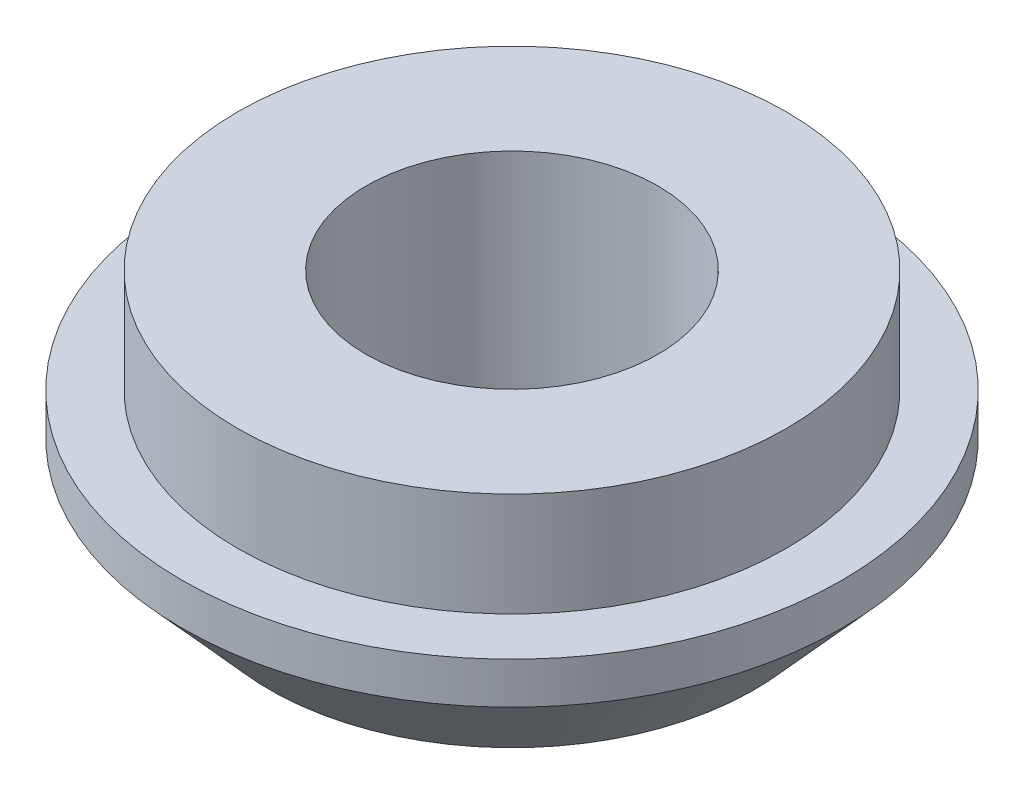
ISO-10303-21;
HEADER;
FILE_DESCRIPTION(('STEP AP214'),'2;1');
FILE_NAME('part.step','',(''),(''),'','','');
FILE_SCHEMA(('AUTOMOTIVE_DESIGN { 1 0 10303 214 1 1 1 1 }'));
ENDSEC;
DATA;
#1=APPLICATION_CONTEXT('core data for automotive mechanical design processes');
#2=APPLICATION_PROTOCOL_DEFINITION('international standard','automotive_design',2000,#1);
#3=PRODUCT_CONTEXT('',#1,'mechanical');
#4=PRODUCT('Part','Part','',(#3));
#5=PRODUCT_RELATED_PRODUCT_CATEGORY('part','',(#4));
#6=PRODUCT_DEFINITION_FORMATION('','',#4);
#7=PRODUCT_DEFINITION_CONTEXT('part definition',#1,'design');
#8=PRODUCT_DEFINITION('design','',#6,#7);
#9=PRODUCT_DEFINITION_SHAPE('','',#8);
#10=(LENGTH_UNIT() NAMED_UNIT(*) SI_UNIT(.MILLI.,.METRE.));
#11=(NAMED_UNIT(*) PLANE_ANGLE_UNIT() SI_UNIT($,.RADIAN.));
#12=(NAMED_UNIT(*) SI_UNIT($,.STERADIAN.) SOLID_ANGLE_UNIT());
#13=UNCERTAINTY_MEASURE_WITH_UNIT(LENGTH_MEASURE(1.E-05),#10,'distance_accuracy_value','');
#14=(GEOMETRIC_REPRESENTATION_CONTEXT(3) GLOBAL_UNCERTAINTY_ASSIGNED_CONTEXT((#13)) GLOBAL_UNIT_ASSIGNED_CONTEXT((#10,
#11,#12)) REPRESENTATION_CONTEXT('',''));
#15=CARTESIAN_POINT('',(0.,0.,0.));
#16=DIRECTION('',(0.,0.,1.));
#17=DIRECTION('',(1.,0.,0.));
#18=AXIS2_PLACEMENT_3D('',#15,#16,#17);
#19=CARTESIAN_POINT('',(-4.44089209850063E-13,7.00000000000009,2.22044604925031E-13));
#20=DIRECTION('',(0.,-1.,0.));
#21=DIRECTION('',(0.,0.,-1.));
#22=AXIS2_PLACEMENT_3D('',#19,#20,#21);
#23=CYLINDRICAL_SURFACE('',#22,9.525);
#24=CARTESIAN_POINT('',(8.88178419700125E-13,4.00000000000023,1.66533453693773E-13));
#25=DIRECTION('',(0.,1.,0.));
#26=DIRECTION('',(0.,0.,1.));
#27=AXIS2_PLACEMENT_3D('',#24,#25,#26);
#28=CIRCLE('',#27,9.525);
#29=CARTESIAN_POINT('',(8.91350881992992E-13,4.00000000000023,9.52500000000016));
#30=VERTEX_POINT('',#29);
#31=EDGE_CURVE('E47',#30,#30,#28,.T.);
#32=ORIENTED_EDGE('',*,*,#31,.F.);
#33=EDGE_LOOP('',(#32));
#34=FACE_BOUND('',#33,.T.);
#35=CARTESIAN_POINT('',(4.44089209850063E-13,2.80000000000014,1.11022302462516E-13));
#36=DIRECTION('',(0.,-1.,0.));
#37=DIRECTION('',(0.,0.,-1.));
#38=AXIS2_PLACEMENT_3D('',#35,#36,#37);
#39=CIRCLE('',#38,9.525);
#40=CARTESIAN_POINT('',(4.40916747557196E-13,2.80000000000013,-9.52499999999989));
#41=VERTEX_POINT('',#40);
#42=EDGE_CURVE('E61',#41,#41,#39,.T.);
#43=ORIENTED_EDGE('',*,*,#42,.F.);
#44=EDGE_LOOP('',(#43));
#45=FACE_BOUND('',#44,.T.);
#46=ADVANCED_FACE('F44',(#34,#45),#23,.T.);
#47=CARTESIAN_POINT('',(0.,0.,0.));
#48=DIRECTION('',(0.,1.,0.));
#49=DIRECTION('',(0.,0.,1.));
#50=AXIS2_PLACEMENT_3D('',#47,#48,#49);
#51=PLANE('',#50);
#52=CARTESIAN_POINT('',(0.,0.,0.));
#53=DIRECTION('',(0.,-1.,0.));
#54=DIRECTION('',(0.,0.,-1.));
#55=AXIS2_PLACEMENT_3D('',#52,#53,#54);
#56=CIRCLE('',#55,4.21639999999999);
#57=CARTESIAN_POINT('',(0.,0.,-4.21639999999999));
#58=VERTEX_POINT('',#57);
#59=EDGE_CURVE('E51',#58,#58,#56,.T.);
#60=ORIENTED_EDGE('',*,*,#59,.F.);
#61=EDGE_LOOP('',(#60));
#62=FACE_BOUND('',#61,.T.);
#63=CARTESIAN_POINT('',(0.,0.,0.));
#64=DIRECTION('',(0.,-1.,0.));
#65=DIRECTION('',(0.,0.,-1.));
#66=AXIS2_PLACEMENT_3D('',#63,#64,#65);
#67=CIRCLE('',#66,7.);
#68=CARTESIAN_POINT('',(0.,0.,-7.));
#69=VERTEX_POINT('',#68);
#70=EDGE_CURVE('E66',#69,#69,#67,.T.);
#71=ORIENTED_EDGE('',*,*,#70,.T.);
#72=EDGE_LOOP('',(#71));
#73=FACE_BOUND('',#72,.T.);
#74=ADVANCED_FACE('F70',(#62,#73),#51,.F.);
#75=CARTESIAN_POINT('',(-4.44089209850063E-13,7.00000000000009,2.22044604925031E-13));
#76=DIRECTION('',(0.,1.,0.));
#77=DIRECTION('',(0.,0.,1.));
#78=AXIS2_PLACEMENT_3D('',#75,#76,#77);
#79=PLANE('',#78);
#80=CARTESIAN_POINT('',(-4.44089209850063E-13,7.00000000000009,2.22044604925031E-13));
#81=DIRECTION('',(0.,-1.,0.));
#82=DIRECTION('',(0.,0.,-1.));
#83=AXIS2_PLACEMENT_3D('',#80,#81,#82);
#84=CIRCLE('',#83,4.2164);
#85=CARTESIAN_POINT('',(-4.45493553158372E-13,7.00000000000009,-4.21639999999977));
#86=VERTEX_POINT('',#85);
#87=EDGE_CURVE('E11',#86,#86,#84,.T.);
#88=ORIENTED_EDGE('',*,*,#87,.T.);
#89=EDGE_LOOP('',(#88));
#90=FACE_BOUND('',#89,.T.);
#91=CARTESIAN_POINT('',(-4.44089209850063E-13,7.00000000000009,2.22044604925031E-13));
#92=DIRECTION('',(0.,1.,0.));
#93=DIRECTION('',(0.,0.,1.));
#94=AXIS2_PLACEMENT_3D('',#91,#92,#93);
#95=CIRCLE('',#94,7.925);
#96=CARTESIAN_POINT('',(-4.41449654609016E-13,7.00000000000009,7.92500000000022));
#97=VERTEX_POINT('',#96);
#98=EDGE_CURVE('E57',#97,#97,#95,.T.);
#99=ORIENTED_EDGE('',*,*,#98,.T.);
#100=EDGE_LOOP('',(#99));
#101=FACE_BOUND('',#100,.T.);
#102=ADVANCED_FACE('F87',(#90,#101),#79,.T.);
#103=CARTESIAN_POINT('',(0.,0.,0.));
#104=DIRECTION('',(0.,-1.,0.));
#105=DIRECTION('',(0.,0.,-1.));
#106=AXIS2_PLACEMENT_3D('',#103,#104,#105);
#107=CYLINDRICAL_SURFACE('',#106,4.21639999999999);
#108=ORIENTED_EDGE('',*,*,#87,.F.);
#109=EDGE_LOOP('',(#108));
#110=FACE_BOUND('',#109,.T.);
#111=ORIENTED_EDGE('',*,*,#59,.T.);
#112=EDGE_LOOP('',(#111));
#113=FACE_BOUND('',#112,.T.);
#114=ADVANCED_FACE('F95',(#110,#113),#107,.F.);
#115=CARTESIAN_POINT('',(8.88178419700125E-13,4.00000000000023,1.66533453693773E-13));
#116=DIRECTION('',(0.,1.,0.));
#117=DIRECTION('',(0.,0.,1.));
#118=AXIS2_PLACEMENT_3D('',#115,#116,#117);
#119=PLANE('',#118);
#120=CARTESIAN_POINT('',(8.88178419700125E-13,4.00000000000023,1.66533453693773E-13));
#121=DIRECTION('',(0.,1.,0.));
#122=DIRECTION('',(0.,0.,1.));
#123=AXIS2_PLACEMENT_3D('',#120,#121,#122);
#124=CIRCLE('',#123,7.925);
#125=CARTESIAN_POINT('',(8.90817974941172E-13,4.00000000000023,7.92500000000016));
#126=VERTEX_POINT('',#125);
#127=EDGE_CURVE('E60',#126,#126,#124,.T.);
#128=ORIENTED_EDGE('',*,*,#127,.F.);
#129=EDGE_LOOP('',(#128));
#130=FACE_BOUND('',#129,.T.);
#131=ORIENTED_EDGE('',*,*,#31,.T.);
#132=EDGE_LOOP('',(#131));
#133=FACE_BOUND('',#132,.T.);
#134=ADVANCED_FACE('F80',(#130,#133),#119,.T.);
#135=CARTESIAN_POINT('',(8.88178419700125E-13,4.00000000000023,1.66533453693773E-13));
#136=DIRECTION('',(0.,1.,0.));
#137=DIRECTION('',(0.,0.,1.));
#138=AXIS2_PLACEMENT_3D('',#135,#136,#137);
#139=CYLINDRICAL_SURFACE('',#138,7.925);
#140=ORIENTED_EDGE('',*,*,#127,.T.);
#141=EDGE_LOOP('',(#140));
#142=FACE_BOUND('',#141,.T.);
#143=ORIENTED_EDGE('',*,*,#98,.F.);
#144=EDGE_LOOP('',(#143));
#145=FACE_BOUND('',#144,.T.);
#146=ADVANCED_FACE('F74',(#142,#145),#139,.T.);
#147=CARTESIAN_POINT('',(0.,0.,0.));
#148=DIRECTION('',(0.,1.,0.));
#149=DIRECTION('',(0.,0.,1.));
#150=AXIS2_PLACEMENT_3D('',#147,#148,#149);
#151=CONICAL_SURFACE('',#150,7.,0.733800808712211);
#152=ORIENTED_EDGE('',*,*,#42,.T.);
#153=EDGE_LOOP('',(#152));
#154=FACE_BOUND('',#153,.T.);
#155=ORIENTED_EDGE('',*,*,#70,.F.);
#156=EDGE_LOOP('',(#155));
#157=FACE_BOUND('',#156,.T.);
#158=ADVANCED_FACE('F72',(#154,#157),#151,.T.);
#159=CLOSED_SHELL('',(#46,#74,#102,#114,#134,#146,#158));
#160=MANIFOLD_SOLID_BREP('B2',#159);
#161=ADVANCED_BREP_SHAPE_REPRESENTATION('',(#18,#160),#14);
#162=SHAPE_DEFINITION_REPRESENTATION(#9,#161);
ENDSEC;
END-ISO-10303-21;
